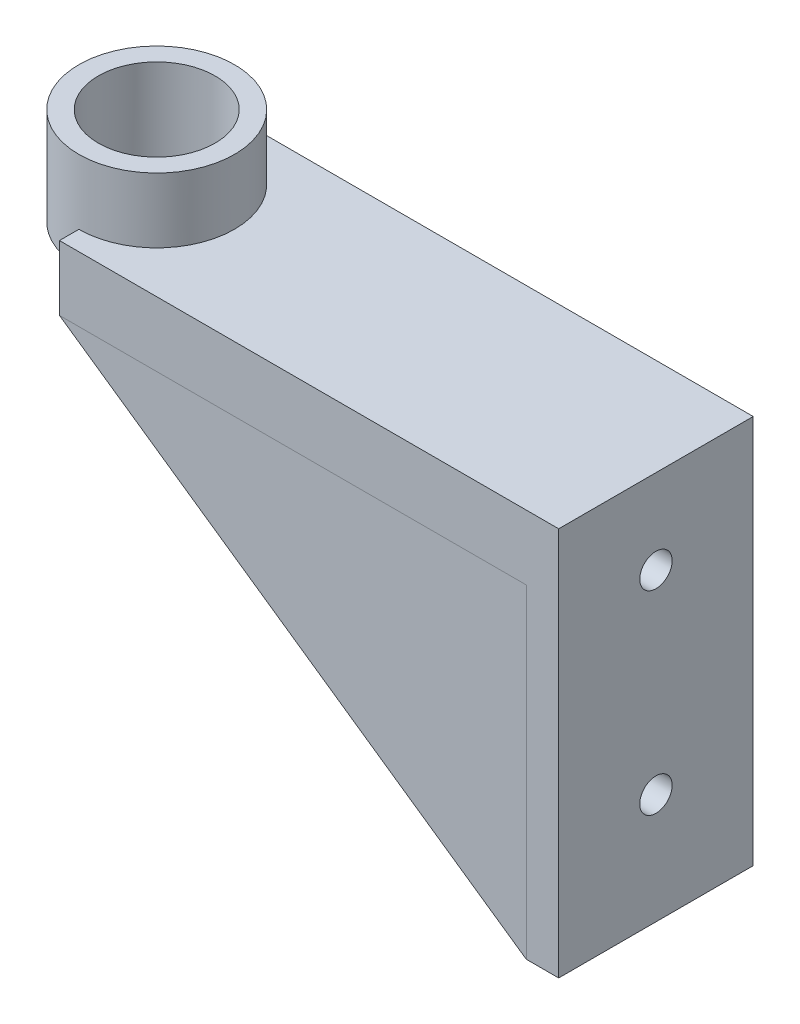
ISO-10303-21;
HEADER;
FILE_DESCRIPTION(('STEP AP214'),'2;1');
FILE_NAME('part.step','',(''),(''),'','','');
FILE_SCHEMA(('AUTOMOTIVE_DESIGN { 1 0 10303 214 1 1 1 1 }'));
ENDSEC;
DATA;
#1=APPLICATION_CONTEXT('core data for automotive mechanical design processes');
#2=APPLICATION_PROTOCOL_DEFINITION('international standard','automotive_design',2000,#1);
#3=PRODUCT_CONTEXT('',#1,'mechanical');
#4=PRODUCT('Part','Part','',(#3));
#5=PRODUCT_RELATED_PRODUCT_CATEGORY('part','',(#4));
#6=PRODUCT_DEFINITION_FORMATION('','',#4);
#7=PRODUCT_DEFINITION_CONTEXT('part definition',#1,'design');
#8=PRODUCT_DEFINITION('design','',#6,#7);
#9=PRODUCT_DEFINITION_SHAPE('','',#8);
#10=(LENGTH_UNIT() NAMED_UNIT(*) SI_UNIT(.MILLI.,.METRE.));
#11=(NAMED_UNIT(*) PLANE_ANGLE_UNIT() SI_UNIT($,.RADIAN.));
#12=(NAMED_UNIT(*) SI_UNIT($,.STERADIAN.) SOLID_ANGLE_UNIT());
#13=UNCERTAINTY_MEASURE_WITH_UNIT(LENGTH_MEASURE(1.E-05),#10,'distance_accuracy_value','');
#14=(GEOMETRIC_REPRESENTATION_CONTEXT(3) GLOBAL_UNCERTAINTY_ASSIGNED_CONTEXT((#13)) GLOBAL_UNIT_ASSIGNED_CONTEXT((#10,
#11,#12)) REPRESENTATION_CONTEXT('',''));
#15=CARTESIAN_POINT('',(0.,0.,0.));
#16=DIRECTION('',(0.,0.,1.));
#17=DIRECTION('',(1.,0.,0.));
#18=AXIS2_PLACEMENT_3D('',#15,#16,#17);
#19=CARTESIAN_POINT('',(72.,-55.,10.));
#20=DIRECTION('',(-0.570395809495344,-0.821369965673296,0.));
#21=DIRECTION('',(0.821369965673296,-0.570395809495344,0.));
#22=AXIS2_PLACEMENT_3D('',#19,#20,#21);
#23=PLANE('',#22);
#24=DIRECTION('',(0.821369965673296,-0.570395809495344,0.));
#25=VECTOR('',#24,1.);
#26=CARTESIAN_POINT('',(72.,-55.,15.));
#27=LINE('',#26,#25);
#28=CARTESIAN_POINT('',(0.,-5.,15.));
#29=VERTEX_POINT('',#28);
#30=CARTESIAN_POINT('',(72.,-55.,15.));
#31=VERTEX_POINT('',#30);
#32=EDGE_CURVE('E95',#29,#31,#27,.T.);
#33=ORIENTED_EDGE('',*,*,#32,.F.);
#34=DIRECTION('',(0.,0.,1.));
#35=VECTOR('',#34,1.);
#36=CARTESIAN_POINT('',(0.,-5.,10.));
#37=LINE('',#36,#35);
#38=CARTESIAN_POINT('',(0.,-5.,10.));
#39=VERTEX_POINT('',#38);
#40=EDGE_CURVE('E12',#39,#29,#37,.T.);
#41=ORIENTED_EDGE('',*,*,#40,.F.);
#42=DIRECTION('',(0.821369965673296,-0.570395809495344,0.));
#43=VECTOR('',#42,1.);
#44=CARTESIAN_POINT('',(72.,-55.,10.));
#45=LINE('',#44,#43);
#46=CARTESIAN_POINT('',(72.,-55.,10.));
#47=VERTEX_POINT('',#46);
#48=EDGE_CURVE('E87',#39,#47,#45,.T.);
#49=ORIENTED_EDGE('',*,*,#48,.T.);
#50=DIRECTION('',(0.,0.,1.));
#51=VECTOR('',#50,1.);
#52=CARTESIAN_POINT('',(72.,-55.,10.));
#53=LINE('',#52,#51);
#54=EDGE_CURVE('E46',#47,#31,#53,.T.);
#55=ORIENTED_EDGE('',*,*,#54,.T.);
#56=EDGE_LOOP('',(#33,#41,#49,#55));
#57=FACE_BOUND('',#56,.T.);
#58=ADVANCED_FACE('F43',(#57),#23,.T.);
#59=CARTESIAN_POINT('',(0.,-5.,10.));
#60=DIRECTION('',(0.,1.,0.));
#61=DIRECTION('',(0.,0.,1.));
#62=AXIS2_PLACEMENT_3D('',#59,#60,#61);
#63=PLANE('',#62);
#64=DIRECTION('',(-1.,0.,0.));
#65=VECTOR('',#64,1.);
#66=CARTESIAN_POINT('',(0.,-5.,15.));
#67=LINE('',#66,#65);
#68=CARTESIAN_POINT('',(72.,-5.,15.));
#69=VERTEX_POINT('',#68);
#70=EDGE_CURVE('E89',#69,#29,#67,.T.);
#71=ORIENTED_EDGE('',*,*,#70,.F.);
#72=DIRECTION('',(0.,0.,1.));
#73=VECTOR('',#72,1.);
#74=CARTESIAN_POINT('',(72.,-5.,10.));
#75=LINE('',#74,#73);
#76=CARTESIAN_POINT('',(72.,-5.,10.));
#77=VERTEX_POINT('',#76);
#78=EDGE_CURVE('E52',#77,#69,#75,.T.);
#79=ORIENTED_EDGE('',*,*,#78,.F.);
#80=DIRECTION('',(-1.,0.,0.));
#81=VECTOR('',#80,1.);
#82=CARTESIAN_POINT('',(0.,-5.,10.));
#83=LINE('',#82,#81);
#84=EDGE_CURVE('E84',#77,#39,#83,.T.);
#85=ORIENTED_EDGE('',*,*,#84,.T.);
#86=ORIENTED_EDGE('',*,*,#40,.T.);
#87=EDGE_LOOP('',(#71,#79,#85,#86));
#88=FACE_BOUND('',#87,.T.);
#89=ADVANCED_FACE('F99',(#88),#63,.T.);
#90=CARTESIAN_POINT('',(72.,-5.,10.));
#91=DIRECTION('',(1.,0.,0.));
#92=DIRECTION('',(0.,0.,-1.));
#93=AXIS2_PLACEMENT_3D('',#90,#91,#92);
#94=PLANE('',#93);
#95=DIRECTION('',(0.,1.,0.));
#96=VECTOR('',#95,1.);
#97=CARTESIAN_POINT('',(72.,-5.,15.));
#98=LINE('',#97,#96);
#99=EDGE_CURVE('E82',#31,#69,#98,.T.);
#100=ORIENTED_EDGE('',*,*,#99,.F.);
#101=ORIENTED_EDGE('',*,*,#54,.F.);
#102=DIRECTION('',(0.,1.,0.));
#103=VECTOR('',#102,1.);
#104=CARTESIAN_POINT('',(72.,-5.,10.));
#105=LINE('',#104,#103);
#106=EDGE_CURVE('E80',#47,#77,#105,.T.);
#107=ORIENTED_EDGE('',*,*,#106,.T.);
#108=ORIENTED_EDGE('',*,*,#78,.T.);
#109=EDGE_LOOP('',(#100,#101,#107,#108));
#110=FACE_BOUND('',#109,.T.);
#111=ADVANCED_FACE('F79',(#110),#94,.T.);
#112=CARTESIAN_POINT('',(0.,0.,9.99999999999999));
#113=DIRECTION('',(0.,0.,1.));
#114=DIRECTION('',(1.,0.,0.));
#115=AXIS2_PLACEMENT_3D('',#112,#113,#114);
#116=PLANE('',#115);
#117=ORIENTED_EDGE('',*,*,#48,.F.);
#118=ORIENTED_EDGE('',*,*,#84,.F.);
#119=ORIENTED_EDGE('',*,*,#106,.F.);
#120=EDGE_LOOP('',(#117,#118,#119));
#121=FACE_BOUND('',#120,.T.);
#122=ADVANCED_FACE('F86',(#121),#116,.F.);
#123=CARTESIAN_POINT('',(0.,0.,15.));
#124=DIRECTION('',(0.,0.,1.));
#125=DIRECTION('',(1.,0.,0.));
#126=AXIS2_PLACEMENT_3D('',#123,#124,#125);
#127=PLANE('',#126);
#128=ORIENTED_EDGE('',*,*,#32,.T.);
#129=ORIENTED_EDGE('',*,*,#99,.T.);
#130=ORIENTED_EDGE('',*,*,#70,.T.);
#131=EDGE_LOOP('',(#128,#129,#130));
#132=FACE_BOUND('',#131,.T.);
#133=ADVANCED_FACE('F98',(#132),#127,.T.);
#134=CLOSED_SHELL('',(#58,#89,#111,#122,#133));
#135=MANIFOLD_SOLID_BREP('B2',#134);
#136=CARTESIAN_POINT('',(77.,-5.,15.));
#137=DIRECTION('',(0.,1.,0.));
#138=DIRECTION('',(0.,0.,1.));
#139=AXIS2_PLACEMENT_3D('',#136,#137,#138);
#140=PLANE('',#139);
#141=DIRECTION('',(0.,0.,-1.));
#142=VECTOR('',#141,1.);
#143=CARTESIAN_POINT('',(0.,-5.,15.));
#144=LINE('',#143,#142);
#145=CARTESIAN_POINT('',(0.,-5.,15.));
#146=VERTEX_POINT('',#145);
#147=CARTESIAN_POINT('',(0.,-5.,-10.));
#148=VERTEX_POINT('',#147);
#149=EDGE_CURVE('E270',#146,#148,#144,.T.);
#150=ORIENTED_EDGE('',*,*,#149,.T.);
#151=DIRECTION('',(1.,0.,0.));
#152=VECTOR('',#151,1.);
#153=CARTESIAN_POINT('',(0.,-5.,-10.));
#154=LINE('',#153,#152);
#155=CARTESIAN_POINT('',(72.,-5.,-10.));
#156=VERTEX_POINT('',#155);
#157=EDGE_CURVE('E230',#148,#156,#154,.T.);
#158=ORIENTED_EDGE('',*,*,#157,.T.);
#159=DIRECTION('',(0.,0.,-1.));
#160=VECTOR('',#159,1.);
#161=CARTESIAN_POINT('',(72.,-5.,15.));
#162=LINE('',#161,#160);
#163=CARTESIAN_POINT('',(72.,-5.,15.));
#164=VERTEX_POINT('',#163);
#165=EDGE_CURVE('E156',#164,#156,#162,.T.);
#166=ORIENTED_EDGE('',*,*,#165,.F.);
#167=DIRECTION('',(-1.,0.,0.));
#168=VECTOR('',#167,1.);
#169=CARTESIAN_POINT('',(77.,-5.,15.));
#170=LINE('',#169,#168);
#171=EDGE_CURVE('E274',#164,#146,#170,.T.);
#172=ORIENTED_EDGE('',*,*,#171,.T.);
#173=EDGE_LOOP('',(#150,#158,#166,#172));
#174=FACE_BOUND('',#173,.T.);
#175=ADVANCED_FACE('F141',(#174),#140,.F.);
#176=CARTESIAN_POINT('',(0.,0.,0.));
#177=DIRECTION('',(-1.,0.,0.));
#178=DIRECTION('',(0.,0.,1.));
#179=AXIS2_PLACEMENT_3D('',#176,#177,#178);
#180=PLANE('',#179);
#181=DIRECTION('',(0.,0.,1.));
#182=VECTOR('',#181,1.);
#183=CARTESIAN_POINT('',(0.,0.,0.));
#184=LINE('',#183,#182);
#185=CARTESIAN_POINT('',(0.,0.,9.));
#186=VERTEX_POINT('',#185);
#187=CARTESIAN_POINT('',(0.,0.,12.));
#188=VERTEX_POINT('',#187);
#189=EDGE_CURVE('E293',#186,#188,#184,.T.);
#190=ORIENTED_EDGE('',*,*,#189,.F.);
#191=DIRECTION('',(0.,0.,1.));
#192=VECTOR('',#191,1.);
#193=CARTESIAN_POINT('',(0.,0.,-9.));
#194=LINE('',#193,#192);
#195=CARTESIAN_POINT('',(0.,0.,-9.));
#196=VERTEX_POINT('',#195);
#197=EDGE_CURVE('E262',#196,#186,#194,.T.);
#198=ORIENTED_EDGE('',*,*,#197,.F.);
#199=CARTESIAN_POINT('',(0.,0.,-12.));
#200=VERTEX_POINT('',#199);
#201=EDGE_CURVE('E296',#200,#196,#184,.T.);
#202=ORIENTED_EDGE('',*,*,#201,.F.);
#203=DIRECTION('',(0.,-1.,0.));
#204=VECTOR('',#203,1.);
#205=CARTESIAN_POINT('',(0.,15.,-12.));
#206=LINE('',#205,#204);
#207=CARTESIAN_POINT('',(0.,5.,-12.));
#208=VERTEX_POINT('',#207);
#209=EDGE_CURVE('E298',#208,#200,#206,.T.);
#210=ORIENTED_EDGE('',*,*,#209,.F.);
#211=DIRECTION('',(0.,0.,1.));
#212=VECTOR('',#211,1.);
#213=CARTESIAN_POINT('',(0.,5.,15.));
#214=LINE('',#213,#212);
#215=CARTESIAN_POINT('',(0.,5.,-15.));
#216=VERTEX_POINT('',#215);
#217=EDGE_CURVE('E278',#216,#208,#214,.T.);
#218=ORIENTED_EDGE('',*,*,#217,.F.);
#219=DIRECTION('',(0.,1.,0.));
#220=VECTOR('',#219,1.);
#221=CARTESIAN_POINT('',(0.,-5.,-15.));
#222=LINE('',#221,#220);
#223=CARTESIAN_POINT('',(0.,-5.,-15.));
#224=VERTEX_POINT('',#223);
#225=EDGE_CURVE('E265',#224,#216,#222,.T.);
#226=ORIENTED_EDGE('',*,*,#225,.F.);
#227=DIRECTION('',(0.,0.,-1.));
#228=VECTOR('',#227,1.);
#229=CARTESIAN_POINT('',(0.,-5.,-10.));
#230=LINE('',#229,#228);
#231=EDGE_CURVE('E229',#148,#224,#230,.T.);
#232=ORIENTED_EDGE('',*,*,#231,.F.);
#233=ORIENTED_EDGE('',*,*,#149,.F.);
#234=DIRECTION('',(0.,-1.,0.));
#235=VECTOR('',#234,1.);
#236=CARTESIAN_POINT('',(0.,-5.,15.));
#237=LINE('',#236,#235);
#238=CARTESIAN_POINT('',(0.,5.,15.));
#239=VERTEX_POINT('',#238);
#240=EDGE_CURVE('E281',#239,#146,#237,.T.);
#241=ORIENTED_EDGE('',*,*,#240,.F.);
#242=CARTESIAN_POINT('',(0.,5.,12.));
#243=VERTEX_POINT('',#242);
#244=EDGE_CURVE('E277',#243,#239,#214,.T.);
#245=ORIENTED_EDGE('',*,*,#244,.F.);
#246=DIRECTION('',(0.,-1.,0.));
#247=VECTOR('',#246,1.);
#248=CARTESIAN_POINT('',(0.,15.,12.));
#249=LINE('',#248,#247);
#250=EDGE_CURVE('E295',#188,#243,#249,.F.);
#251=ORIENTED_EDGE('',*,*,#250,.F.);
#252=EDGE_LOOP('',(#190,#198,#202,#210,#218,#226,#232,#233,#241,#245,#251));
#253=FACE_BOUND('',#252,.T.);
#254=ADVANCED_FACE('F318',(#253),#180,.T.);
#255=CARTESIAN_POINT('',(0.,15.,0.));
#256=DIRECTION('',(0.,1.,0.));
#257=DIRECTION('',(0.,0.,1.));
#258=AXIS2_PLACEMENT_3D('',#255,#256,#257);
#259=PLANE('',#258);
#260=CARTESIAN_POINT('',(0.,15.,0.));
#261=DIRECTION('',(0.,1.,0.));
#262=DIRECTION('',(0.,0.,1.));
#263=AXIS2_PLACEMENT_3D('',#260,#261,#262);
#264=CIRCLE('',#263,12.);
#265=CARTESIAN_POINT('',(0.,15.,12.));
#266=VERTEX_POINT('',#265);
#267=EDGE_CURVE('E41',#266,#266,#264,.T.);
#268=ORIENTED_EDGE('',*,*,#267,.T.);
#269=EDGE_LOOP('',(#268));
#270=FACE_BOUND('',#269,.T.);
#271=CARTESIAN_POINT('',(0.,15.,0.));
#272=DIRECTION('',(0.,1.,0.));
#273=DIRECTION('',(0.,0.,1.));
#274=AXIS2_PLACEMENT_3D('',#271,#272,#273);
#275=CIRCLE('',#274,9.);
#276=CARTESIAN_POINT('',(0.,15.,9.));
#277=VERTEX_POINT('',#276);
#278=EDGE_CURVE('E302',#277,#277,#275,.T.);
#279=ORIENTED_EDGE('',*,*,#278,.F.);
#280=EDGE_LOOP('',(#279));
#281=FACE_BOUND('',#280,.T.);
#282=ADVANCED_FACE('F354',(#270,#281),#259,.T.);
#283=CARTESIAN_POINT('',(0.,0.,0.));
#284=DIRECTION('',(0.,1.,0.));
#285=DIRECTION('',(0.,0.,1.));
#286=AXIS2_PLACEMENT_3D('',#283,#284,#285);
#287=PLANE('',#286);
#288=CARTESIAN_POINT('',(0.,0.,0.));
#289=DIRECTION('',(0.,1.,0.));
#290=DIRECTION('',(0.,0.,1.));
#291=AXIS2_PLACEMENT_3D('',#288,#289,#290);
#292=CIRCLE('',#291,12.);
#293=EDGE_CURVE('E145',#200,#188,#292,.T.);
#294=ORIENTED_EDGE('',*,*,#293,.F.);
#295=ORIENTED_EDGE('',*,*,#201,.T.);
#296=CARTESIAN_POINT('',(0.,0.,0.));
#297=DIRECTION('',(0.,1.,0.));
#298=DIRECTION('',(0.,0.,1.));
#299=AXIS2_PLACEMENT_3D('',#296,#297,#298);
#300=CIRCLE('',#299,9.);
#301=EDGE_CURVE('E301',#196,#186,#300,.T.);
#302=ORIENTED_EDGE('',*,*,#301,.T.);
#303=ORIENTED_EDGE('',*,*,#189,.T.);
#304=EDGE_LOOP('',(#294,#295,#302,#303));
#305=FACE_BOUND('',#304,.T.);
#306=ADVANCED_FACE('F311',(#305),#287,.F.);
#307=CARTESIAN_POINT('',(0.,15.,0.));
#308=DIRECTION('',(0.,-1.,0.));
#309=DIRECTION('',(0.,0.,-1.));
#310=AXIS2_PLACEMENT_3D('',#307,#308,#309);
#311=CYLINDRICAL_SURFACE('',#310,12.);
#312=ORIENTED_EDGE('',*,*,#267,.F.);
#313=EDGE_LOOP('',(#312));
#314=FACE_BOUND('',#313,.T.);
#315=CARTESIAN_POINT('',(0.,5.,0.));
#316=DIRECTION('',(0.,-1.,0.));
#317=DIRECTION('',(0.,0.,-1.));
#318=AXIS2_PLACEMENT_3D('',#315,#316,#317);
#319=CIRCLE('',#318,12.);
#320=EDGE_CURVE('E164',#208,#243,#319,.T.);
#321=ORIENTED_EDGE('',*,*,#320,.F.);
#322=ORIENTED_EDGE('',*,*,#209,.T.);
#323=ORIENTED_EDGE('',*,*,#293,.T.);
#324=ORIENTED_EDGE('',*,*,#250,.T.);
#325=EDGE_LOOP('',(#321,#322,#323,#324));
#326=FACE_BOUND('',#325,.T.);
#327=ADVANCED_FACE('F143',(#314,#326),#311,.T.);
#328=CARTESIAN_POINT('',(0.,15.,0.));
#329=DIRECTION('',(0.,-1.,0.));
#330=DIRECTION('',(0.,0.,-1.));
#331=AXIS2_PLACEMENT_3D('',#328,#329,#330);
#332=CYLINDRICAL_SURFACE('',#331,9.);
#333=ORIENTED_EDGE('',*,*,#301,.F.);
#334=CARTESIAN_POINT('',(0.,0.,0.));
#335=DIRECTION('',(0.,1.,0.));
#336=DIRECTION('',(0.,0.,1.));
#337=AXIS2_PLACEMENT_3D('',#334,#335,#336);
#338=CIRCLE('',#337,9.);
#339=EDGE_CURVE('E260',#186,#196,#338,.T.);
#340=ORIENTED_EDGE('',*,*,#339,.F.);
#341=EDGE_LOOP('',(#333,#340));
#342=FACE_BOUND('',#341,.T.);
#343=ORIENTED_EDGE('',*,*,#278,.T.);
#344=EDGE_LOOP('',(#343));
#345=FACE_BOUND('',#344,.T.);
#346=ADVANCED_FACE('F364',(#342,#345),#332,.F.);
#347=CARTESIAN_POINT('',(77.,-5.,-15.));
#348=DIRECTION('',(0.,0.,1.));
#349=DIRECTION('',(1.,0.,0.));
#350=AXIS2_PLACEMENT_3D('',#347,#348,#349);
#351=PLANE('',#350);
#352=DIRECTION('',(-0.821369965673296,0.570395809495344,0.));
#353=VECTOR('',#352,1.);
#354=CARTESIAN_POINT('',(72.,-55.,-15.));
#355=LINE('',#354,#353);
#356=CARTESIAN_POINT('',(72.,-55.,-15.));
#357=VERTEX_POINT('',#356);
#358=EDGE_CURVE('E224',#357,#224,#355,.T.);
#359=ORIENTED_EDGE('',*,*,#358,.T.);
#360=ORIENTED_EDGE('',*,*,#225,.T.);
#361=DIRECTION('',(-1.,0.,0.));
#362=VECTOR('',#361,1.);
#363=CARTESIAN_POINT('',(77.,5.,-15.));
#364=LINE('',#363,#362);
#365=CARTESIAN_POINT('',(77.,5.,-15.));
#366=VERTEX_POINT('',#365);
#367=EDGE_CURVE('E290',#366,#216,#364,.T.);
#368=ORIENTED_EDGE('',*,*,#367,.F.);
#369=DIRECTION('',(0.,1.,0.));
#370=VECTOR('',#369,1.);
#371=CARTESIAN_POINT('',(77.,-5.,-15.));
#372=LINE('',#371,#370);
#373=CARTESIAN_POINT('',(77.,-55.,-15.));
#374=VERTEX_POINT('',#373);
#375=EDGE_CURVE('E266',#374,#366,#372,.T.);
#376=ORIENTED_EDGE('',*,*,#375,.F.);
#377=DIRECTION('',(1.,0.,0.));
#378=VECTOR('',#377,1.);
#379=CARTESIAN_POINT('',(77.,-55.,-15.));
#380=LINE('',#379,#378);
#381=EDGE_CURVE('E249',#357,#374,#380,.T.);
#382=ORIENTED_EDGE('',*,*,#381,.F.);
#383=EDGE_LOOP('',(#359,#360,#368,#376,#382));
#384=FACE_BOUND('',#383,.T.);
#385=ADVANCED_FACE('F328',(#384),#351,.F.);
#386=CARTESIAN_POINT('',(77.,5.,15.));
#387=DIRECTION('',(0.,-1.,0.));
#388=DIRECTION('',(0.,0.,-1.));
#389=AXIS2_PLACEMENT_3D('',#386,#387,#388);
#390=PLANE('',#389);
#391=ORIENTED_EDGE('',*,*,#217,.T.);
#392=ORIENTED_EDGE('',*,*,#320,.T.);
#393=ORIENTED_EDGE('',*,*,#244,.T.);
#394=DIRECTION('',(-1.,0.,0.));
#395=VECTOR('',#394,1.);
#396=CARTESIAN_POINT('',(77.,5.,15.));
#397=LINE('',#396,#395);
#398=CARTESIAN_POINT('',(77.,5.,15.));
#399=VERTEX_POINT('',#398);
#400=EDGE_CURVE('E287',#399,#239,#397,.T.);
#401=ORIENTED_EDGE('',*,*,#400,.F.);
#402=DIRECTION('',(0.,0.,1.));
#403=VECTOR('',#402,1.);
#404=CARTESIAN_POINT('',(77.,5.,15.));
#405=LINE('',#404,#403);
#406=EDGE_CURVE('E269',#366,#399,#405,.T.);
#407=ORIENTED_EDGE('',*,*,#406,.F.);
#408=ORIENTED_EDGE('',*,*,#367,.T.);
#409=EDGE_LOOP('',(#391,#392,#393,#401,#407,#408));
#410=FACE_BOUND('',#409,.T.);
#411=ADVANCED_FACE('F322',(#410),#390,.F.);
#412=CARTESIAN_POINT('',(77.,-5.,15.));
#413=DIRECTION('',(0.,0.,-1.));
#414=DIRECTION('',(-1.,0.,0.));
#415=AXIS2_PLACEMENT_3D('',#412,#413,#414);
#416=PLANE('',#415);
#417=ORIENTED_EDGE('',*,*,#240,.T.);
#418=ORIENTED_EDGE('',*,*,#171,.F.);
#419=DIRECTION('',(0.,1.,0.));
#420=VECTOR('',#419,1.);
#421=CARTESIAN_POINT('',(72.,-55.,15.));
#422=LINE('',#421,#420);
#423=CARTESIAN_POINT('',(72.,-55.,15.));
#424=VERTEX_POINT('',#423);
#425=EDGE_CURVE('E251',#424,#164,#422,.T.);
#426=ORIENTED_EDGE('',*,*,#425,.F.);
#427=DIRECTION('',(-1.,0.,0.));
#428=VECTOR('',#427,1.);
#429=CARTESIAN_POINT('',(77.,-55.,15.));
#430=LINE('',#429,#428);
#431=CARTESIAN_POINT('',(77.,-55.,15.));
#432=VERTEX_POINT('',#431);
#433=EDGE_CURVE('E247',#432,#424,#430,.T.);
#434=ORIENTED_EDGE('',*,*,#433,.F.);
#435=DIRECTION('',(0.,-1.,0.));
#436=VECTOR('',#435,1.);
#437=CARTESIAN_POINT('',(77.,-5.,15.));
#438=LINE('',#437,#436);
#439=EDGE_CURVE('E272',#399,#432,#438,.T.);
#440=ORIENTED_EDGE('',*,*,#439,.F.);
#441=ORIENTED_EDGE('',*,*,#400,.T.);
#442=EDGE_LOOP('',(#417,#418,#426,#434,#440,#441));
#443=FACE_BOUND('',#442,.T.);
#444=ADVANCED_FACE('F348',(#443),#416,.F.);
#445=CARTESIAN_POINT('',(77.,0.,0.));
#446=DIRECTION('',(-1.,0.,0.));
#447=DIRECTION('',(0.,0.,1.));
#448=AXIS2_PLACEMENT_3D('',#445,#446,#447);
#449=PLANE('',#448);
#450=CARTESIAN_POINT('',(77.,-8.,0.));
#451=DIRECTION('',(-1.,0.,0.));
#452=DIRECTION('',(0.,0.,1.));
#453=AXIS2_PLACEMENT_3D('',#450,#451,#452);
#454=CIRCLE('',#453,2.5);
#455=CARTESIAN_POINT('',(77.,-8.,2.5));
#456=VERTEX_POINT('',#455);
#457=EDGE_CURVE('E258',#456,#456,#454,.T.);
#458=ORIENTED_EDGE('',*,*,#457,.T.);
#459=EDGE_LOOP('',(#458));
#460=FACE_BOUND('',#459,.T.);
#461=CARTESIAN_POINT('',(77.,-38.,0.));
#462=DIRECTION('',(-1.,0.,0.));
#463=DIRECTION('',(0.,0.,1.));
#464=AXIS2_PLACEMENT_3D('',#461,#462,#463);
#465=CIRCLE('',#464,2.5);
#466=CARTESIAN_POINT('',(77.,-38.,2.5));
#467=VERTEX_POINT('',#466);
#468=EDGE_CURVE('E339',#467,#467,#465,.T.);
#469=ORIENTED_EDGE('',*,*,#468,.T.);
#470=EDGE_LOOP('',(#469));
#471=FACE_BOUND('',#470,.T.);
#472=ORIENTED_EDGE('',*,*,#375,.T.);
#473=ORIENTED_EDGE('',*,*,#406,.T.);
#474=ORIENTED_EDGE('',*,*,#439,.T.);
#475=DIRECTION('',(0.,0.,1.));
#476=VECTOR('',#475,1.);
#477=CARTESIAN_POINT('',(77.,-55.,15.));
#478=LINE('',#477,#476);
#479=EDGE_CURVE('E253',#374,#432,#478,.T.);
#480=ORIENTED_EDGE('',*,*,#479,.F.);
#481=EDGE_LOOP('',(#472,#473,#474,#480));
#482=FACE_BOUND('',#481,.T.);
#483=ADVANCED_FACE('F345',(#460,#471,#482),#449,.F.);
#484=CARTESIAN_POINT('',(0.,0.,0.));
#485=DIRECTION('',(0.,1.,0.));
#486=DIRECTION('',(0.,0.,1.));
#487=AXIS2_PLACEMENT_3D('',#484,#485,#486);
#488=PLANE('',#487);
#489=ORIENTED_EDGE('',*,*,#339,.T.);
#490=ORIENTED_EDGE('',*,*,#197,.T.);
#491=EDGE_LOOP('',(#489,#490));
#492=FACE_BOUND('',#491,.T.);
#493=ADVANCED_FACE('F406',(#492),#488,.T.);
#494=CARTESIAN_POINT('',(72.,-55.,15.));
#495=DIRECTION('',(1.,0.,0.));
#496=DIRECTION('',(0.,0.,-1.));
#497=AXIS2_PLACEMENT_3D('',#494,#495,#496);
#498=PLANE('',#497);
#499=CARTESIAN_POINT('',(72.,-8.,0.));
#500=DIRECTION('',(-1.,0.,0.));
#501=DIRECTION('',(0.,0.,1.));
#502=AXIS2_PLACEMENT_3D('',#499,#500,#501);
#503=CIRCLE('',#502,2.5);
#504=CARTESIAN_POINT('',(72.,-8.,2.5));
#505=VERTEX_POINT('',#504);
#506=EDGE_CURVE('E336',#505,#505,#503,.T.);
#507=ORIENTED_EDGE('',*,*,#506,.F.);
#508=EDGE_LOOP('',(#507));
#509=FACE_BOUND('',#508,.T.);
#510=CARTESIAN_POINT('',(72.,-38.,0.));
#511=DIRECTION('',(-1.,0.,0.));
#512=DIRECTION('',(0.,0.,1.));
#513=AXIS2_PLACEMENT_3D('',#510,#511,#512);
#514=CIRCLE('',#513,2.5);
#515=CARTESIAN_POINT('',(72.,-38.,2.5));
#516=VERTEX_POINT('',#515);
#517=EDGE_CURVE('E332',#516,#516,#514,.T.);
#518=ORIENTED_EDGE('',*,*,#517,.F.);
#519=EDGE_LOOP('',(#518));
#520=FACE_BOUND('',#519,.T.);
#521=ORIENTED_EDGE('',*,*,#165,.T.);
#522=DIRECTION('',(0.,-1.,0.));
#523=VECTOR('',#522,1.);
#524=CARTESIAN_POINT('',(72.,-5.,-10.));
#525=LINE('',#524,#523);
#526=CARTESIAN_POINT('',(72.,-55.,-10.));
#527=VERTEX_POINT('',#526);
#528=EDGE_CURVE('E235',#156,#527,#525,.T.);
#529=ORIENTED_EDGE('',*,*,#528,.T.);
#530=DIRECTION('',(0.,0.,-1.));
#531=VECTOR('',#530,1.);
#532=CARTESIAN_POINT('',(72.,-55.,15.));
#533=LINE('',#532,#531);
#534=EDGE_CURVE('E242',#424,#527,#533,.T.);
#535=ORIENTED_EDGE('',*,*,#534,.F.);
#536=ORIENTED_EDGE('',*,*,#425,.T.);
#537=EDGE_LOOP('',(#521,#529,#535,#536));
#538=FACE_BOUND('',#537,.T.);
#539=ADVANCED_FACE('F240',(#509,#520,#538),#498,.F.);
#540=CARTESIAN_POINT('',(0.,-55.,0.));
#541=DIRECTION('',(0.,1.,0.));
#542=DIRECTION('',(0.,0.,1.));
#543=AXIS2_PLACEMENT_3D('',#540,#541,#542);
#544=PLANE('',#543);
#545=ORIENTED_EDGE('',*,*,#479,.T.);
#546=ORIENTED_EDGE('',*,*,#433,.T.);
#547=ORIENTED_EDGE('',*,*,#534,.T.);
#548=DIRECTION('',(0.,0.,-1.));
#549=VECTOR('',#548,1.);
#550=CARTESIAN_POINT('',(72.,-55.,-10.));
#551=LINE('',#550,#549);
#552=EDGE_CURVE('E218',#527,#357,#551,.T.);
#553=ORIENTED_EDGE('',*,*,#552,.T.);
#554=ORIENTED_EDGE('',*,*,#381,.T.);
#555=EDGE_LOOP('',(#545,#546,#547,#553,#554));
#556=FACE_BOUND('',#555,.T.);
#557=ADVANCED_FACE('F245',(#556),#544,.F.);
#558=CARTESIAN_POINT('',(77.,-38.,0.));
#559=DIRECTION('',(-1.,0.,0.));
#560=DIRECTION('',(0.,0.,1.));
#561=AXIS2_PLACEMENT_3D('',#558,#559,#560);
#562=CYLINDRICAL_SURFACE('',#561,2.5);
#563=ORIENTED_EDGE('',*,*,#468,.F.);
#564=EDGE_LOOP('',(#563));
#565=FACE_BOUND('',#564,.T.);
#566=ORIENTED_EDGE('',*,*,#517,.T.);
#567=EDGE_LOOP('',(#566));
#568=FACE_BOUND('',#567,.T.);
#569=ADVANCED_FACE('F426',(#565,#568),#562,.F.);
#570=CARTESIAN_POINT('',(77.,-8.,0.));
#571=DIRECTION('',(-1.,0.,0.));
#572=DIRECTION('',(0.,0.,1.));
#573=AXIS2_PLACEMENT_3D('',#570,#571,#572);
#574=CYLINDRICAL_SURFACE('',#573,2.5);
#575=ORIENTED_EDGE('',*,*,#457,.F.);
#576=EDGE_LOOP('',(#575));
#577=FACE_BOUND('',#576,.T.);
#578=ORIENTED_EDGE('',*,*,#506,.T.);
#579=EDGE_LOOP('',(#578));
#580=FACE_BOUND('',#579,.T.);
#581=ADVANCED_FACE('F433',(#577,#580),#574,.F.);
#582=CARTESIAN_POINT('',(72.,-55.,-10.));
#583=DIRECTION('',(-0.570395809495344,-0.821369965673296,0.));
#584=DIRECTION('',(0.821369965673296,-0.570395809495344,0.));
#585=AXIS2_PLACEMENT_3D('',#582,#583,#584);
#586=PLANE('',#585);
#587=ORIENTED_EDGE('',*,*,#358,.F.);
#588=ORIENTED_EDGE('',*,*,#552,.F.);
#589=DIRECTION('',(-0.821369965673296,0.570395809495344,0.));
#590=VECTOR('',#589,1.);
#591=CARTESIAN_POINT('',(72.,-55.,-10.));
#592=LINE('',#591,#590);
#593=EDGE_CURVE('E221',#527,#148,#592,.T.);
#594=ORIENTED_EDGE('',*,*,#593,.T.);
#595=ORIENTED_EDGE('',*,*,#231,.T.);
#596=EDGE_LOOP('',(#587,#588,#594,#595));
#597=FACE_BOUND('',#596,.T.);
#598=ADVANCED_FACE('F220',(#597),#586,.T.);
#599=CARTESIAN_POINT('',(0.,0.,-10.));
#600=DIRECTION('',(0.,0.,1.));
#601=DIRECTION('',(1.,0.,0.));
#602=AXIS2_PLACEMENT_3D('',#599,#600,#601);
#603=PLANE('',#602);
#604=ORIENTED_EDGE('',*,*,#528,.F.);
#605=ORIENTED_EDGE('',*,*,#157,.F.);
#606=ORIENTED_EDGE('',*,*,#593,.F.);
#607=EDGE_LOOP('',(#604,#605,#606));
#608=FACE_BOUND('',#607,.T.);
#609=ADVANCED_FACE('F234',(#608),#603,.T.);
#610=CLOSED_SHELL('',(#175,#254,#282,#306,#327,#346,#385,#411,#444,#483,#493,#539,#557,#569,
#581,#598,#609));
#611=MANIFOLD_SOLID_BREP('B6',#610);
#612=ADVANCED_BREP_SHAPE_REPRESENTATION('',(#18,#135,#611),#14);
#613=SHAPE_DEFINITION_REPRESENTATION(#9,#612);
ENDSEC;
END-ISO-10303-21;
